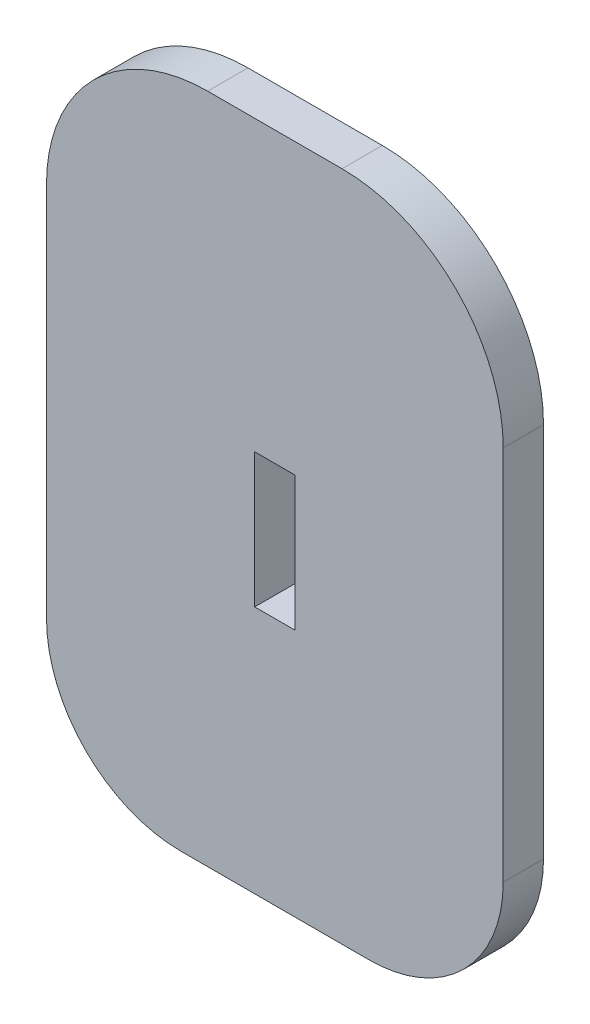
ISO-10303-21;
HEADER;
FILE_DESCRIPTION(('STEP AP214'),'2;1');
FILE_NAME('part.step','',(''),(''),'','','');
FILE_SCHEMA(('AUTOMOTIVE_DESIGN { 1 0 10303 214 1 1 1 1 }'));
ENDSEC;
DATA;
#1=APPLICATION_CONTEXT('core data for automotive mechanical design processes');
#2=APPLICATION_PROTOCOL_DEFINITION('international standard','automotive_design',2000,#1);
#3=PRODUCT_CONTEXT('',#1,'mechanical');
#4=PRODUCT('Part','Part','',(#3));
#5=PRODUCT_RELATED_PRODUCT_CATEGORY('part','',(#4));
#6=PRODUCT_DEFINITION_FORMATION('','',#4);
#7=PRODUCT_DEFINITION_CONTEXT('part definition',#1,'design');
#8=PRODUCT_DEFINITION('design','',#6,#7);
#9=PRODUCT_DEFINITION_SHAPE('','',#8);
#10=(LENGTH_UNIT() NAMED_UNIT(*) SI_UNIT(.MILLI.,.METRE.));
#11=(NAMED_UNIT(*) PLANE_ANGLE_UNIT() SI_UNIT($,.RADIAN.));
#12=(NAMED_UNIT(*) SI_UNIT($,.STERADIAN.) SOLID_ANGLE_UNIT());
#13=UNCERTAINTY_MEASURE_WITH_UNIT(LENGTH_MEASURE(1.E-05),#10,'distance_accuracy_value','');
#14=(GEOMETRIC_REPRESENTATION_CONTEXT(3) GLOBAL_UNCERTAINTY_ASSIGNED_CONTEXT((#13)) GLOBAL_UNIT_ASSIGNED_CONTEXT((#10,
#11,#12)) REPRESENTATION_CONTEXT('',''));
#15=CARTESIAN_POINT('',(0.,0.,0.));
#16=DIRECTION('',(0.,0.,1.));
#17=DIRECTION('',(1.,0.,0.));
#18=AXIS2_PLACEMENT_3D('',#15,#16,#17);
#19=CARTESIAN_POINT('',(-5.,-33.5,3.));
#20=DIRECTION('',(0.,0.,-1.));
#21=DIRECTION('',(-1.,0.,0.));
#22=AXIS2_PLACEMENT_3D('',#19,#20,#21);
#23=CYLINDRICAL_SURFACE('',#22,12.);
#24=CARTESIAN_POINT('',(-5.,-33.5,0.));
#25=DIRECTION('',(0.,0.,1.));
#26=DIRECTION('',(-1.,0.,0.));
#27=AXIS2_PLACEMENT_3D('',#24,#25,#26);
#28=CIRCLE('',#27,12.);
#29=CARTESIAN_POINT('',(-5.,-21.5,0.));
#30=VERTEX_POINT('',#29);
#31=CARTESIAN_POINT('',(-17.,-33.5,0.));
#32=VERTEX_POINT('',#31);
#33=EDGE_CURVE('E150',#30,#32,#28,.T.);
#34=ORIENTED_EDGE('',*,*,#33,.T.);
#35=DIRECTION('',(0.,0.,-1.));
#36=VECTOR('',#35,1.);
#37=CARTESIAN_POINT('',(-17.,-33.5,3.));
#38=LINE('',#37,#36);
#39=CARTESIAN_POINT('',(-17.,-33.5,3.));
#40=VERTEX_POINT('',#39);
#41=EDGE_CURVE('E208',#40,#32,#38,.T.);
#42=ORIENTED_EDGE('',*,*,#41,.F.);
#43=CARTESIAN_POINT('',(-5.,-33.5,3.));
#44=DIRECTION('',(0.,0.,1.));
#45=DIRECTION('',(-1.,0.,0.));
#46=AXIS2_PLACEMENT_3D('',#43,#44,#45);
#47=CIRCLE('',#46,12.);
#48=CARTESIAN_POINT('',(-5.,-21.5,3.));
#49=VERTEX_POINT('',#48);
#50=EDGE_CURVE('E153',#49,#40,#47,.T.);
#51=ORIENTED_EDGE('',*,*,#50,.F.);
#52=DIRECTION('',(0.,0.,-1.));
#53=VECTOR('',#52,1.);
#54=CARTESIAN_POINT('',(-5.,-21.5,3.));
#55=LINE('',#54,#53);
#56=EDGE_CURVE('E171',#49,#30,#55,.T.);
#57=ORIENTED_EDGE('',*,*,#56,.T.);
#58=EDGE_LOOP('',(#34,#42,#51,#57));
#59=FACE_BOUND('',#58,.T.);
#60=ADVANCED_FACE('F37',(#59),#23,.T.);
#61=CARTESIAN_POINT('',(-17.,-33.5,3.));
#62=DIRECTION('',(1.,0.,0.));
#63=DIRECTION('',(0.,1.,0.));
#64=AXIS2_PLACEMENT_3D('',#61,#62,#63);
#65=PLANE('',#64);
#66=DIRECTION('',(0.,-1.,0.));
#67=VECTOR('',#66,1.);
#68=CARTESIAN_POINT('',(-17.,-33.5,0.));
#69=LINE('',#68,#67);
#70=CARTESIAN_POINT('',(-17.,-61.5,0.));
#71=VERTEX_POINT('',#70);
#72=EDGE_CURVE('E174',#32,#71,#69,.T.);
#73=ORIENTED_EDGE('',*,*,#72,.T.);
#74=DIRECTION('',(0.,0.,-1.));
#75=VECTOR('',#74,1.);
#76=CARTESIAN_POINT('',(-17.,-61.5,3.));
#77=LINE('',#76,#75);
#78=CARTESIAN_POINT('',(-17.,-61.5,3.));
#79=VERTEX_POINT('',#78);
#80=EDGE_CURVE('E205',#79,#71,#77,.T.);
#81=ORIENTED_EDGE('',*,*,#80,.F.);
#82=DIRECTION('',(0.,-1.,0.));
#83=VECTOR('',#82,1.);
#84=CARTESIAN_POINT('',(-17.,-33.5,3.));
#85=LINE('',#84,#83);
#86=EDGE_CURVE('E156',#40,#79,#85,.T.);
#87=ORIENTED_EDGE('',*,*,#86,.F.);
#88=ORIENTED_EDGE('',*,*,#41,.T.);
#89=EDGE_LOOP('',(#73,#81,#87,#88));
#90=FACE_BOUND('',#89,.T.);
#91=ADVANCED_FACE('F234',(#90),#65,.F.);
#92=CARTESIAN_POINT('',(-6.99999999999998,-61.5,3.));
#93=DIRECTION('',(0.,0.,-1.));
#94=DIRECTION('',(-1.,0.,0.));
#95=AXIS2_PLACEMENT_3D('',#92,#93,#94);
#96=CYLINDRICAL_SURFACE('',#95,10.);
#97=CARTESIAN_POINT('',(-6.99999999999998,-61.5,0.));
#98=DIRECTION('',(0.,0.,1.));
#99=DIRECTION('',(1.,0.,0.));
#100=AXIS2_PLACEMENT_3D('',#97,#98,#99);
#101=CIRCLE('',#100,10.);
#102=CARTESIAN_POINT('',(-6.99999999999998,-71.5,0.));
#103=VERTEX_POINT('',#102);
#104=EDGE_CURVE('E176',#71,#103,#101,.T.);
#105=ORIENTED_EDGE('',*,*,#104,.T.);
#106=DIRECTION('',(0.,0.,-1.));
#107=VECTOR('',#106,1.);
#108=CARTESIAN_POINT('',(-6.99999999999998,-71.5,3.));
#109=LINE('',#108,#107);
#110=CARTESIAN_POINT('',(-6.99999999999998,-71.5,3.));
#111=VERTEX_POINT('',#110);
#112=EDGE_CURVE('E202',#111,#103,#109,.T.);
#113=ORIENTED_EDGE('',*,*,#112,.F.);
#114=CARTESIAN_POINT('',(-6.99999999999998,-61.5,3.));
#115=DIRECTION('',(0.,0.,1.));
#116=DIRECTION('',(1.,0.,0.));
#117=AXIS2_PLACEMENT_3D('',#114,#115,#116);
#118=CIRCLE('',#117,10.);
#119=EDGE_CURVE('E159',#79,#111,#118,.T.);
#120=ORIENTED_EDGE('',*,*,#119,.F.);
#121=ORIENTED_EDGE('',*,*,#80,.T.);
#122=EDGE_LOOP('',(#105,#113,#120,#121));
#123=FACE_BOUND('',#122,.T.);
#124=ADVANCED_FACE('F239',(#123),#96,.T.);
#125=CARTESIAN_POINT('',(0.500000000000002,-71.5,3.));
#126=DIRECTION('',(0.,1.,0.));
#127=DIRECTION('',(0.,0.,1.));
#128=AXIS2_PLACEMENT_3D('',#125,#126,#127);
#129=PLANE('',#128);
#130=DIRECTION('',(1.,0.,0.));
#131=VECTOR('',#130,1.);
#132=CARTESIAN_POINT('',(0.500000000000002,-71.5,0.));
#133=LINE('',#132,#131);
#134=CARTESIAN_POINT('',(6.99999999999999,-71.5,0.));
#135=VERTEX_POINT('',#134);
#136=EDGE_CURVE('E179',#103,#135,#133,.T.);
#137=ORIENTED_EDGE('',*,*,#136,.T.);
#138=DIRECTION('',(0.,0.,-1.));
#139=VECTOR('',#138,1.);
#140=CARTESIAN_POINT('',(6.99999999999999,-71.5,3.));
#141=LINE('',#140,#139);
#142=CARTESIAN_POINT('',(6.99999999999999,-71.5,3.));
#143=VERTEX_POINT('',#142);
#144=EDGE_CURVE('E199',#143,#135,#141,.T.);
#145=ORIENTED_EDGE('',*,*,#144,.F.);
#146=DIRECTION('',(1.,0.,0.));
#147=VECTOR('',#146,1.);
#148=CARTESIAN_POINT('',(-6.99999999999998,-71.5,3.));
#149=LINE('',#148,#147);
#150=EDGE_CURVE('E161',#111,#143,#149,.T.);
#151=ORIENTED_EDGE('',*,*,#150,.F.);
#152=ORIENTED_EDGE('',*,*,#112,.T.);
#153=EDGE_LOOP('',(#137,#145,#151,#152));
#154=FACE_BOUND('',#153,.T.);
#155=ADVANCED_FACE('F270',(#154),#129,.F.);
#156=CARTESIAN_POINT('',(6.99999999999999,-61.5,3.));
#157=DIRECTION('',(0.,0.,-1.));
#158=DIRECTION('',(-1.,0.,0.));
#159=AXIS2_PLACEMENT_3D('',#156,#157,#158);
#160=CYLINDRICAL_SURFACE('',#159,10.);
#161=CARTESIAN_POINT('',(6.99999999999999,-61.5,0.));
#162=DIRECTION('',(0.,0.,1.));
#163=DIRECTION('',(1.,0.,0.));
#164=AXIS2_PLACEMENT_3D('',#161,#162,#163);
#165=CIRCLE('',#164,10.);
#166=CARTESIAN_POINT('',(17.,-61.5,0.));
#167=VERTEX_POINT('',#166);
#168=EDGE_CURVE('E181',#135,#167,#165,.T.);
#169=ORIENTED_EDGE('',*,*,#168,.T.);
#170=DIRECTION('',(0.,0.,-1.));
#171=VECTOR('',#170,1.);
#172=CARTESIAN_POINT('',(17.,-61.5,3.));
#173=LINE('',#172,#171);
#174=CARTESIAN_POINT('',(17.,-61.5,3.));
#175=VERTEX_POINT('',#174);
#176=EDGE_CURVE('E196',#175,#167,#173,.T.);
#177=ORIENTED_EDGE('',*,*,#176,.F.);
#178=CARTESIAN_POINT('',(6.99999999999999,-61.5,3.));
#179=DIRECTION('',(0.,0.,1.));
#180=DIRECTION('',(1.,0.,0.));
#181=AXIS2_PLACEMENT_3D('',#178,#179,#180);
#182=CIRCLE('',#181,10.);
#183=EDGE_CURVE('E163',#143,#175,#182,.T.);
#184=ORIENTED_EDGE('',*,*,#183,.F.);
#185=ORIENTED_EDGE('',*,*,#144,.T.);
#186=EDGE_LOOP('',(#169,#177,#184,#185));
#187=FACE_BOUND('',#186,.T.);
#188=ADVANCED_FACE('F266',(#187),#160,.T.);
#189=CARTESIAN_POINT('',(17.,-33.5,3.));
#190=DIRECTION('',(-1.,0.,0.));
#191=DIRECTION('',(0.,0.,1.));
#192=AXIS2_PLACEMENT_3D('',#189,#190,#191);
#193=PLANE('',#192);
#194=DIRECTION('',(0.,1.,0.));
#195=VECTOR('',#194,1.);
#196=CARTESIAN_POINT('',(17.,-33.5,0.));
#197=LINE('',#196,#195);
#198=CARTESIAN_POINT('',(17.,-33.5,0.));
#199=VERTEX_POINT('',#198);
#200=EDGE_CURVE('E183',#167,#199,#197,.T.);
#201=ORIENTED_EDGE('',*,*,#200,.T.);
#202=DIRECTION('',(0.,0.,-1.));
#203=VECTOR('',#202,1.);
#204=CARTESIAN_POINT('',(17.,-33.5,3.));
#205=LINE('',#204,#203);
#206=CARTESIAN_POINT('',(17.,-33.5,3.));
#207=VERTEX_POINT('',#206);
#208=EDGE_CURVE('E193',#207,#199,#205,.T.);
#209=ORIENTED_EDGE('',*,*,#208,.F.);
#210=DIRECTION('',(0.,1.,0.));
#211=VECTOR('',#210,1.);
#212=CARTESIAN_POINT('',(17.,-33.5,3.));
#213=LINE('',#212,#211);
#214=EDGE_CURVE('E165',#175,#207,#213,.T.);
#215=ORIENTED_EDGE('',*,*,#214,.F.);
#216=ORIENTED_EDGE('',*,*,#176,.T.);
#217=EDGE_LOOP('',(#201,#209,#215,#216));
#218=FACE_BOUND('',#217,.T.);
#219=ADVANCED_FACE('F261',(#218),#193,.F.);
#220=CARTESIAN_POINT('',(5.,-33.5,3.));
#221=DIRECTION('',(0.,0.,-1.));
#222=DIRECTION('',(-1.,0.,0.));
#223=AXIS2_PLACEMENT_3D('',#220,#221,#222);
#224=CYLINDRICAL_SURFACE('',#223,12.);
#225=CARTESIAN_POINT('',(5.,-33.5,0.));
#226=DIRECTION('',(0.,0.,1.));
#227=DIRECTION('',(-1.,0.,0.));
#228=AXIS2_PLACEMENT_3D('',#225,#226,#227);
#229=CIRCLE('',#228,12.);
#230=CARTESIAN_POINT('',(4.99999999999999,-21.5,0.));
#231=VERTEX_POINT('',#230);
#232=EDGE_CURVE('E185',#199,#231,#229,.T.);
#233=ORIENTED_EDGE('',*,*,#232,.T.);
#234=DIRECTION('',(0.,0.,-1.));
#235=VECTOR('',#234,1.);
#236=CARTESIAN_POINT('',(4.99999999999999,-21.5,3.));
#237=LINE('',#236,#235);
#238=CARTESIAN_POINT('',(4.99999999999999,-21.5,3.));
#239=VERTEX_POINT('',#238);
#240=EDGE_CURVE('E190',#239,#231,#237,.T.);
#241=ORIENTED_EDGE('',*,*,#240,.F.);
#242=CARTESIAN_POINT('',(5.,-33.5,3.));
#243=DIRECTION('',(0.,0.,1.));
#244=DIRECTION('',(-1.,0.,0.));
#245=AXIS2_PLACEMENT_3D('',#242,#243,#244);
#246=CIRCLE('',#245,12.);
#247=EDGE_CURVE('E167',#207,#239,#246,.T.);
#248=ORIENTED_EDGE('',*,*,#247,.F.);
#249=ORIENTED_EDGE('',*,*,#208,.T.);
#250=EDGE_LOOP('',(#233,#241,#248,#249));
#251=FACE_BOUND('',#250,.T.);
#252=ADVANCED_FACE('F256',(#251),#224,.T.);
#253=CARTESIAN_POINT('',(-5.,-21.5,3.));
#254=DIRECTION('',(0.,-1.,0.));
#255=DIRECTION('',(0.,0.,-1.));
#256=AXIS2_PLACEMENT_3D('',#253,#254,#255);
#257=PLANE('',#256);
#258=DIRECTION('',(-1.,0.,0.));
#259=VECTOR('',#258,1.);
#260=CARTESIAN_POINT('',(-5.,-21.5,0.));
#261=LINE('',#260,#259);
#262=EDGE_CURVE('E157',#231,#30,#261,.T.);
#263=ORIENTED_EDGE('',*,*,#262,.T.);
#264=ORIENTED_EDGE('',*,*,#56,.F.);
#265=DIRECTION('',(-1.,0.,0.));
#266=VECTOR('',#265,1.);
#267=CARTESIAN_POINT('',(-5.,-21.5,3.));
#268=LINE('',#267,#266);
#269=EDGE_CURVE('E169',#239,#49,#268,.T.);
#270=ORIENTED_EDGE('',*,*,#269,.F.);
#271=ORIENTED_EDGE('',*,*,#240,.T.);
#272=EDGE_LOOP('',(#263,#264,#270,#271));
#273=FACE_BOUND('',#272,.T.);
#274=ADVANCED_FACE('F254',(#273),#257,.F.);
#275=CARTESIAN_POINT('',(-5.,-33.5,3.));
#276=DIRECTION('',(0.,0.,-1.));
#277=DIRECTION('',(-1.,0.,0.));
#278=AXIS2_PLACEMENT_3D('',#275,#276,#277);
#279=PLANE('',#278);
#280=DIRECTION('',(-1.,0.,0.));
#281=VECTOR('',#280,1.);
#282=CARTESIAN_POINT('',(-1.5,-43.,3.));
#283=LINE('',#282,#281);
#284=CARTESIAN_POINT('',(1.5,-43.,3.));
#285=VERTEX_POINT('',#284);
#286=CARTESIAN_POINT('',(-1.5,-43.,3.));
#287=VERTEX_POINT('',#286);
#288=EDGE_CURVE('E136',#285,#287,#283,.T.);
#289=ORIENTED_EDGE('',*,*,#288,.F.);
#290=DIRECTION('',(0.,1.,0.));
#291=VECTOR('',#290,1.);
#292=CARTESIAN_POINT('',(1.5,-53.,3.));
#293=LINE('',#292,#291);
#294=CARTESIAN_POINT('',(1.5,-53.,3.));
#295=VERTEX_POINT('',#294);
#296=EDGE_CURVE('E51',#295,#285,#293,.T.);
#297=ORIENTED_EDGE('',*,*,#296,.F.);
#298=DIRECTION('',(1.,0.,0.));
#299=VECTOR('',#298,1.);
#300=CARTESIAN_POINT('',(-1.5,-53.,3.));
#301=LINE('',#300,#299);
#302=CARTESIAN_POINT('',(-1.5,-53.,3.));
#303=VERTEX_POINT('',#302);
#304=EDGE_CURVE('E143',#303,#295,#301,.T.);
#305=ORIENTED_EDGE('',*,*,#304,.F.);
#306=DIRECTION('',(0.,-1.,0.));
#307=VECTOR('',#306,1.);
#308=CARTESIAN_POINT('',(-1.5,-53.,3.));
#309=LINE('',#308,#307);
#310=EDGE_CURVE('E127',#287,#303,#309,.T.);
#311=ORIENTED_EDGE('',*,*,#310,.F.);
#312=EDGE_LOOP('',(#289,#297,#305,#311));
#313=FACE_BOUND('',#312,.T.);
#314=ORIENTED_EDGE('',*,*,#50,.T.);
#315=ORIENTED_EDGE('',*,*,#86,.T.);
#316=ORIENTED_EDGE('',*,*,#119,.T.);
#317=ORIENTED_EDGE('',*,*,#150,.T.);
#318=ORIENTED_EDGE('',*,*,#183,.T.);
#319=ORIENTED_EDGE('',*,*,#214,.T.);
#320=ORIENTED_EDGE('',*,*,#247,.T.);
#321=ORIENTED_EDGE('',*,*,#269,.T.);
#322=EDGE_LOOP('',(#314,#315,#316,#317,#318,#319,#320,#321));
#323=FACE_BOUND('',#322,.T.);
#324=ADVANCED_FACE('F140',(#313,#323),#279,.F.);
#325=CARTESIAN_POINT('',(-5.,-33.5,0.));
#326=DIRECTION('',(0.,0.,-1.));
#327=DIRECTION('',(-1.,0.,0.));
#328=AXIS2_PLACEMENT_3D('',#325,#326,#327);
#329=PLANE('',#328);
#330=DIRECTION('',(0.,-1.,0.));
#331=VECTOR('',#330,1.);
#332=CARTESIAN_POINT('',(1.5,-33.5,0.));
#333=LINE('',#332,#331);
#334=CARTESIAN_POINT('',(1.5,-43.,0.));
#335=VERTEX_POINT('',#334);
#336=CARTESIAN_POINT('',(1.5,-53.,0.));
#337=VERTEX_POINT('',#336);
#338=EDGE_CURVE('E11',#335,#337,#333,.T.);
#339=ORIENTED_EDGE('',*,*,#338,.F.);
#340=DIRECTION('',(1.,0.,0.));
#341=VECTOR('',#340,1.);
#342=CARTESIAN_POINT('',(-5.,-43.,0.));
#343=LINE('',#342,#341);
#344=CARTESIAN_POINT('',(-1.5,-43.,0.));
#345=VERTEX_POINT('',#344);
#346=EDGE_CURVE('E211',#345,#335,#343,.T.);
#347=ORIENTED_EDGE('',*,*,#346,.F.);
#348=DIRECTION('',(0.,1.,0.));
#349=VECTOR('',#348,1.);
#350=CARTESIAN_POINT('',(-1.5,-33.5,0.));
#351=LINE('',#350,#349);
#352=CARTESIAN_POINT('',(-1.5,-53.,0.));
#353=VERTEX_POINT('',#352);
#354=EDGE_CURVE('E130',#353,#345,#351,.T.);
#355=ORIENTED_EDGE('',*,*,#354,.F.);
#356=DIRECTION('',(-1.,0.,0.));
#357=VECTOR('',#356,1.);
#358=CARTESIAN_POINT('',(-5.,-53.,0.));
#359=LINE('',#358,#357);
#360=EDGE_CURVE('E44',#337,#353,#359,.T.);
#361=ORIENTED_EDGE('',*,*,#360,.F.);
#362=EDGE_LOOP('',(#339,#347,#355,#361));
#363=FACE_BOUND('',#362,.T.);
#364=ORIENTED_EDGE('',*,*,#33,.F.);
#365=ORIENTED_EDGE('',*,*,#262,.F.);
#366=ORIENTED_EDGE('',*,*,#232,.F.);
#367=ORIENTED_EDGE('',*,*,#200,.F.);
#368=ORIENTED_EDGE('',*,*,#168,.F.);
#369=ORIENTED_EDGE('',*,*,#136,.F.);
#370=ORIENTED_EDGE('',*,*,#104,.F.);
#371=ORIENTED_EDGE('',*,*,#72,.F.);
#372=EDGE_LOOP('',(#364,#365,#366,#367,#368,#369,#370,#371));
#373=FACE_BOUND('',#372,.T.);
#374=ADVANCED_FACE('F219',(#363,#373),#329,.T.);
#375=CARTESIAN_POINT('',(1.5,-53.,-7.));
#376=DIRECTION('',(1.,0.,0.));
#377=DIRECTION('',(0.,0.,-1.));
#378=AXIS2_PLACEMENT_3D('',#375,#376,#377);
#379=PLANE('',#378);
#380=ORIENTED_EDGE('',*,*,#338,.T.);
#381=DIRECTION('',(0.,0.,1.));
#382=VECTOR('',#381,1.);
#383=CARTESIAN_POINT('',(1.5,-53.,-7.));
#384=LINE('',#383,#382);
#385=EDGE_CURVE('E148',#337,#295,#384,.T.);
#386=ORIENTED_EDGE('',*,*,#385,.T.);
#387=ORIENTED_EDGE('',*,*,#296,.T.);
#388=DIRECTION('',(0.,0.,1.));
#389=VECTOR('',#388,1.);
#390=CARTESIAN_POINT('',(1.5,-43.,-7.));
#391=LINE('',#390,#389);
#392=EDGE_CURVE('E133',#335,#285,#391,.T.);
#393=ORIENTED_EDGE('',*,*,#392,.F.);
#394=EDGE_LOOP('',(#380,#386,#387,#393));
#395=FACE_BOUND('',#394,.T.);
#396=ADVANCED_FACE('F221',(#395),#379,.F.);
#397=CARTESIAN_POINT('',(-1.5,-53.,-7.));
#398=DIRECTION('',(0.,-1.,0.));
#399=DIRECTION('',(0.,0.,-1.));
#400=AXIS2_PLACEMENT_3D('',#397,#398,#399);
#401=PLANE('',#400);
#402=ORIENTED_EDGE('',*,*,#360,.T.);
#403=DIRECTION('',(0.,0.,1.));
#404=VECTOR('',#403,1.);
#405=CARTESIAN_POINT('',(-1.5,-53.,-7.));
#406=LINE('',#405,#404);
#407=EDGE_CURVE('E132',#353,#303,#406,.T.);
#408=ORIENTED_EDGE('',*,*,#407,.T.);
#409=ORIENTED_EDGE('',*,*,#304,.T.);
#410=ORIENTED_EDGE('',*,*,#385,.F.);
#411=EDGE_LOOP('',(#402,#408,#409,#410));
#412=FACE_BOUND('',#411,.T.);
#413=ADVANCED_FACE('F216',(#412),#401,.F.);
#414=CARTESIAN_POINT('',(-1.5,-53.,-7.));
#415=DIRECTION('',(-1.,0.,0.));
#416=DIRECTION('',(0.,0.,1.));
#417=AXIS2_PLACEMENT_3D('',#414,#415,#416);
#418=PLANE('',#417);
#419=ORIENTED_EDGE('',*,*,#354,.T.);
#420=DIRECTION('',(0.,0.,1.));
#421=VECTOR('',#420,1.);
#422=CARTESIAN_POINT('',(-1.5,-43.,-7.));
#423=LINE('',#422,#421);
#424=EDGE_CURVE('E59',#345,#287,#423,.T.);
#425=ORIENTED_EDGE('',*,*,#424,.T.);
#426=ORIENTED_EDGE('',*,*,#310,.T.);
#427=ORIENTED_EDGE('',*,*,#407,.F.);
#428=EDGE_LOOP('',(#419,#425,#426,#427));
#429=FACE_BOUND('',#428,.T.);
#430=ADVANCED_FACE('F124',(#429),#418,.F.);
#431=CARTESIAN_POINT('',(-1.5,-43.,-7.));
#432=DIRECTION('',(0.,1.,0.));
#433=DIRECTION('',(0.,0.,1.));
#434=AXIS2_PLACEMENT_3D('',#431,#432,#433);
#435=PLANE('',#434);
#436=ORIENTED_EDGE('',*,*,#346,.T.);
#437=ORIENTED_EDGE('',*,*,#392,.T.);
#438=ORIENTED_EDGE('',*,*,#288,.T.);
#439=ORIENTED_EDGE('',*,*,#424,.F.);
#440=EDGE_LOOP('',(#436,#437,#438,#439));
#441=FACE_BOUND('',#440,.T.);
#442=ADVANCED_FACE('F137',(#441),#435,.F.);
#443=CLOSED_SHELL('',(#60,#91,#124,#155,#188,#219,#252,#274,#324,#374,#396,#413,#430,#442));
#444=MANIFOLD_SOLID_BREP('B2',#443);
#445=ADVANCED_BREP_SHAPE_REPRESENTATION('',(#18,#444),#14);
#446=SHAPE_DEFINITION_REPRESENTATION(#9,#445);
ENDSEC;
END-ISO-10303-21;
